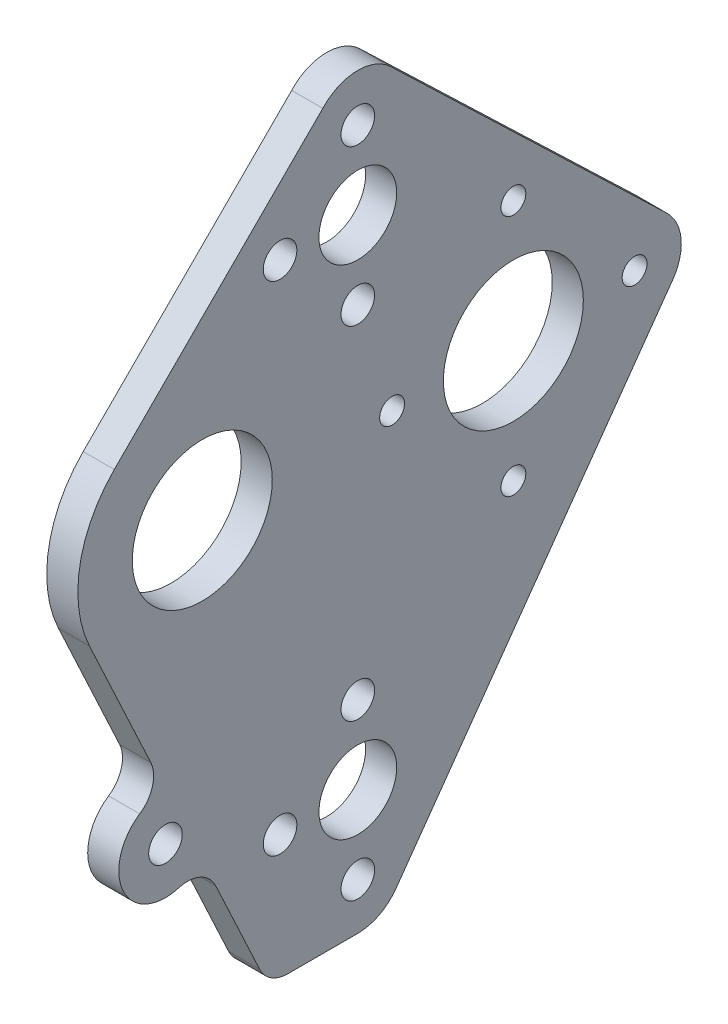
ISO-10303-21;
HEADER;
FILE_DESCRIPTION(('STEP AP214'),'2;1');
FILE_NAME('part.step','',(''),(''),'','','');
FILE_SCHEMA(('AUTOMOTIVE_DESIGN { 1 0 10303 214 1 1 1 1 }'));
ENDSEC;
DATA;
#1=APPLICATION_CONTEXT('core data for automotive mechanical design processes');
#2=APPLICATION_PROTOCOL_DEFINITION('international standard','automotive_design',2000,#1);
#3=PRODUCT_CONTEXT('',#1,'mechanical');
#4=PRODUCT('Part','Part','',(#3));
#5=PRODUCT_RELATED_PRODUCT_CATEGORY('part','',(#4));
#6=PRODUCT_DEFINITION_FORMATION('','',#4);
#7=PRODUCT_DEFINITION_CONTEXT('part definition',#1,'design');
#8=PRODUCT_DEFINITION('design','',#6,#7);
#9=PRODUCT_DEFINITION_SHAPE('','',#8);
#10=(LENGTH_UNIT() NAMED_UNIT(*) SI_UNIT(.MILLI.,.METRE.));
#11=(NAMED_UNIT(*) PLANE_ANGLE_UNIT() SI_UNIT($,.RADIAN.));
#12=(NAMED_UNIT(*) SI_UNIT($,.STERADIAN.) SOLID_ANGLE_UNIT());
#13=UNCERTAINTY_MEASURE_WITH_UNIT(LENGTH_MEASURE(1.E-05),#10,'distance_accuracy_value','');
#14=(GEOMETRIC_REPRESENTATION_CONTEXT(3) GLOBAL_UNCERTAINTY_ASSIGNED_CONTEXT((#13)) GLOBAL_UNIT_ASSIGNED_CONTEXT((#10,
#11,#12)) REPRESENTATION_CONTEXT('',''));
#15=CARTESIAN_POINT('',(0.,0.,0.));
#16=DIRECTION('',(0.,0.,1.));
#17=DIRECTION('',(1.,0.,0.));
#18=AXIS2_PLACEMENT_3D('',#15,#16,#17);
#19=CARTESIAN_POINT('',(6.35,-68.6728859953783,22.0595562798087));
#20=DIRECTION('',(1.,0.,0.));
#21=DIRECTION('',(0.,0.,-1.));
#22=AXIS2_PLACEMENT_3D('',#19,#20,#21);
#23=PLANE('',#22);
#24=CARTESIAN_POINT('',(6.35,-24.7523,-44.4500000000005));
#25=DIRECTION('',(1.,0.,0.));
#26=DIRECTION('',(0.,0.,-1.));
#27=AXIS2_PLACEMENT_3D('',#24,#25,#26);
#28=CIRCLE('',#27,2.54);
#29=CARTESIAN_POINT('',(6.35,-24.7523,-46.9900000000005));
#30=VERTEX_POINT('',#29);
#31=EDGE_CURVE('E412',#30,#30,#28,.T.);
#32=ORIENTED_EDGE('',*,*,#31,.F.);
#33=EDGE_LOOP('',(#32));
#34=FACE_BOUND('',#33,.T.);
#35=CARTESIAN_POINT('',(6.35,24.7523,-44.45));
#36=DIRECTION('',(1.,0.,0.));
#37=DIRECTION('',(0.,0.,-1.));
#38=AXIS2_PLACEMENT_3D('',#35,#36,#37);
#39=CIRCLE('',#38,2.54);
#40=CARTESIAN_POINT('',(6.35,24.7523,-46.99));
#41=VERTEX_POINT('',#40);
#42=EDGE_CURVE('E428',#41,#41,#39,.T.);
#43=ORIENTED_EDGE('',*,*,#42,.F.);
#44=EDGE_LOOP('',(#43));
#45=FACE_BOUND('',#44,.T.);
#46=CARTESIAN_POINT('',(6.35,-79.375,-12.7));
#47=DIRECTION('',(1.,0.,0.));
#48=DIRECTION('',(0.,0.,-1.));
#49=AXIS2_PLACEMENT_3D('',#46,#47,#48);
#50=CIRCLE('',#49,3.42900000000002);
#51=CARTESIAN_POINT('',(6.35,-79.375,-16.129));
#52=VERTEX_POINT('',#51);
#53=EDGE_CURVE('E444',#52,#52,#50,.T.);
#54=ORIENTED_EDGE('',*,*,#53,.F.);
#55=EDGE_LOOP('',(#54));
#56=FACE_BOUND('',#55,.T.);
#57=CARTESIAN_POINT('',(6.35,-63.5,3.17499999999996));
#58=DIRECTION('',(1.,0.,0.));
#59=DIRECTION('',(0.,0.,-1.));
#60=AXIS2_PLACEMENT_3D('',#57,#58,#59);
#61=CIRCLE('',#60,3.429);
#62=CARTESIAN_POINT('',(6.35,-63.5,-0.25400000000004));
#63=VERTEX_POINT('',#62);
#64=EDGE_CURVE('E460',#63,#63,#61,.T.);
#65=ORIENTED_EDGE('',*,*,#64,.F.);
#66=EDGE_LOOP('',(#65));
#67=FACE_BOUND('',#66,.T.);
#68=CARTESIAN_POINT('',(6.35,38.1,3.17500000000001));
#69=DIRECTION('',(1.,0.,0.));
#70=DIRECTION('',(0.,0.,-1.));
#71=AXIS2_PLACEMENT_3D('',#68,#69,#70);
#72=CIRCLE('',#71,3.42899999999915);
#73=CARTESIAN_POINT('',(6.35,38.1,-0.253999999999145));
#74=VERTEX_POINT('',#73);
#75=EDGE_CURVE('E476',#74,#74,#72,.T.);
#76=ORIENTED_EDGE('',*,*,#75,.F.);
#77=EDGE_LOOP('',(#76));
#78=FACE_BOUND('',#77,.T.);
#79=CARTESIAN_POINT('',(6.35,-53.4497190103263,26.5618681243196));
#80=DIRECTION('',(1.,0.,0.));
#81=DIRECTION('',(0.,0.,-1.));
#82=AXIS2_PLACEMENT_3D('',#79,#80,#81);
#83=CIRCLE('',#82,3.429);
#84=CARTESIAN_POINT('',(6.35,-53.4497190103263,23.1328681243196));
#85=VERTEX_POINT('',#84);
#86=EDGE_CURVE('E492',#85,#85,#83,.T.);
#87=ORIENTED_EDGE('',*,*,#86,.F.);
#88=EDGE_LOOP('',(#87));
#89=FACE_BOUND('',#88,.T.);
#90=CARTESIAN_POINT('',(6.35,38.1000000000001,-12.7));
#91=DIRECTION('',(1.,0.,0.));
#92=DIRECTION('',(0.,0.,-1.));
#93=AXIS2_PLACEMENT_3D('',#90,#91,#92);
#94=CIRCLE('',#93,7.93750000000001);
#95=CARTESIAN_POINT('',(6.35,38.1000000000001,-20.6375));
#96=VERTEX_POINT('',#95);
#97=EDGE_CURVE('E508',#96,#96,#94,.T.);
#98=ORIENTED_EDGE('',*,*,#97,.F.);
#99=EDGE_LOOP('',(#98));
#100=FACE_BOUND('',#99,.T.);
#101=CARTESIAN_POINT('',(6.35,-68.6728859953783,22.0595562798087));
#102=DIRECTION('',(-1.,0.,0.));
#103=DIRECTION('',(0.,0.,-1.));
#104=AXIS2_PLACEMENT_3D('',#101,#102,#103);
#105=CIRCLE('',#104,6.35);
#106=CARTESIAN_POINT('',(6.35,-62.5836192013575,23.8604810176131));
#107=VERTEX_POINT('',#106);
#108=CARTESIAN_POINT('',(6.35,-65.9892600333248,16.304501832126));
#109=VERTEX_POINT('',#108);
#110=EDGE_CURVE('E222',#107,#109,#105,.T.);
#111=ORIENTED_EDGE('',*,*,#110,.T.);
#112=DIRECTION('',(0.,-0.906307787036648,-0.422618261740704));
#113=VECTOR('',#112,1.);
#114=CARTESIAN_POINT('',(6.35,-65.9892600333248,16.304501832126));
#115=LINE('',#114,#113);
#116=CARTESIAN_POINT('',(6.35,-85.2336259620534,7.33070662322261));
#117=VERTEX_POINT('',#116);
#118=EDGE_CURVE('E122',#109,#117,#115,.T.);
#119=ORIENTED_EDGE('',*,*,#118,.T.);
#120=CARTESIAN_POINT('',(6.35,-82.55,1.57565217553989));
#121=DIRECTION('',(1.,0.,0.));
#122=DIRECTION('',(0.,0.,-1.));
#123=AXIS2_PLACEMENT_3D('',#120,#121,#122);
#124=CIRCLE('',#123,6.34999999999999);
#125=CARTESIAN_POINT('',(6.35,-88.9,1.57565217553985));
#126=VERTEX_POINT('',#125);
#127=EDGE_CURVE('E267',#117,#126,#124,.T.);
#128=ORIENTED_EDGE('',*,*,#127,.T.);
#129=DIRECTION('',(0.,0.,-1.));
#130=VECTOR('',#129,1.);
#131=CARTESIAN_POINT('',(6.35,-88.9,-12.7));
#132=LINE('',#131,#130);
#133=CARTESIAN_POINT('',(6.35,-88.9,-12.7));
#134=VERTEX_POINT('',#133);
#135=EDGE_CURVE('E287',#126,#134,#132,.T.);
#136=ORIENTED_EDGE('',*,*,#135,.T.);
#137=CARTESIAN_POINT('',(6.35,-79.375,-12.7));
#138=DIRECTION('',(1.,0.,0.));
#139=DIRECTION('',(0.,0.,-1.));
#140=AXIS2_PLACEMENT_3D('',#137,#138,#139);
#141=CIRCLE('',#140,9.525);
#142=CARTESIAN_POINT('',(6.35,-84.8987198737333,-20.4597773007042));
#143=VERTEX_POINT('',#142);
#144=EDGE_CURVE('E283',#134,#143,#141,.T.);
#145=ORIENTED_EDGE('',*,*,#144,.T.);
#146=DIRECTION('',(0.,0.814674782226162,-0.579918096979871));
#147=VECTOR('',#146,1.);
#148=CARTESIAN_POINT('',(6.35,-5.52371987373327,-76.9620773007042));
#149=LINE('',#148,#147);
#150=CARTESIAN_POINT('',(6.35,-5.52371987373327,-76.9620773007042));
#151=VERTEX_POINT('',#150);
#152=EDGE_CURVE('E286',#143,#151,#149,.T.);
#153=ORIENTED_EDGE('',*,*,#152,.T.);
#154=CARTESIAN_POINT('',(6.35,2.70616862252382E-13,-69.2023000000003));
#155=DIRECTION('',(1.,0.,0.));
#156=DIRECTION('',(0.,0.,-1.));
#157=AXIS2_PLACEMENT_3D('',#154,#155,#156);
#158=CIRCLE('',#157,9.52499999999973);
#159=CARTESIAN_POINT('',(6.35,6.87319553611122,-75.796601185295));
#160=VERTEX_POINT('',#159);
#161=EDGE_CURVE('E291',#151,#160,#158,.T.);
#162=ORIENTED_EDGE('',*,*,#161,.T.);
#163=DIRECTION('',(0.,0.692315085070336,0.721595331875182));
#164=VECTOR('',#163,1.);
#165=CARTESIAN_POINT('',(6.35,6.87319553611111,-75.7966011852949));
#166=LINE('',#165,#164);
#167=CARTESIAN_POINT('',(6.35,60.9703519515181,-19.4115008474721));
#168=VERTEX_POINT('',#167);
#169=EDGE_CURVE('E298',#160,#168,#166,.T.);
#170=ORIENTED_EDGE('',*,*,#169,.T.);
#171=CARTESIAN_POINT('',(6.35,53.9750000000001,-12.7000000000001));
#172=DIRECTION('',(1.,0.,0.));
#173=DIRECTION('',(0.,0.,-1.));
#174=AXIS2_PLACEMENT_3D('',#171,#172,#173);
#175=CIRCLE('',#174,9.69428659320659);
#176=CARTESIAN_POINT('',(6.35,60.5158891281602,-5.544864643884));
#177=VERTEX_POINT('',#176);
#178=EDGE_CURVE('E301',#168,#177,#175,.T.);
#179=ORIENTED_EDGE('',*,*,#178,.T.);
#180=DIRECTION('',(0.,-0.707106781186544,0.707106781186551));
#181=VECTOR('',#180,1.);
#182=CARTESIAN_POINT('',(6.35,17.9605122421384,37.0105122421382));
#183=LINE('',#182,#181);
#184=CARTESIAN_POINT('',(6.35,17.9605122421384,37.0105122421382));
#185=VERTEX_POINT('',#184);
#186=EDGE_CURVE('E304',#177,#185,#183,.T.);
#187=ORIENTED_EDGE('',*,*,#186,.T.);
#188=CARTESIAN_POINT('',(6.35,0.,19.05));
#189=DIRECTION('',(1.,0.,0.));
#190=DIRECTION('',(0.,0.,-1.));
#191=AXIS2_PLACEMENT_3D('',#188,#189,#190);
#192=CIRCLE('',#191,25.4);
#193=CARTESIAN_POINT('',(6.35,-10.7345038482139,42.0702177907309));
#194=VERTEX_POINT('',#193);
#195=EDGE_CURVE('E159',#185,#194,#192,.T.);
#196=ORIENTED_EDGE('',*,*,#195,.T.);
#197=DIRECTION('',(0.,-0.906307787036648,-0.422618261740704));
#198=VECTOR('',#197,1.);
#199=CARTESIAN_POINT('',(6.35,-10.7345038482139,42.0702177907309));
#200=LINE('',#199,#198);
#201=CARTESIAN_POINT('',(6.35,-37.531858960416,29.5744058836119));
#202=VERTEX_POINT('',#201);
#203=EDGE_CURVE('E153',#194,#202,#200,.T.);
#204=ORIENTED_EDGE('',*,*,#203,.T.);
#205=CARTESIAN_POINT('',(6.35,-40.2154849224695,35.3294603312946));
#206=DIRECTION('',(-1.,0.,0.));
#207=DIRECTION('',(0.,0.,-1.));
#208=AXIS2_PLACEMENT_3D('',#205,#206,#207);
#209=CIRCLE('',#208,6.35);
#210=CARTESIAN_POINT('',(6.35,-45.5091785576122,31.8224234485046));
#211=VERTEX_POINT('',#210);
#212=EDGE_CURVE('E157',#202,#211,#209,.T.);
#213=ORIENTED_EDGE('',*,*,#212,.T.);
#214=CARTESIAN_POINT('',(6.35,-53.4497190103263,26.5618681243196));
#215=DIRECTION('',(1.,0.,0.));
#216=DIRECTION('',(0.,0.,-1.));
#217=AXIS2_PLACEMENT_3D('',#214,#215,#216);
#218=CIRCLE('',#217,9.525);
#219=EDGE_CURVE('E61',#211,#107,#218,.T.);
#220=ORIENTED_EDGE('',*,*,#219,.T.);
#221=EDGE_LOOP('',(#111,#119,#128,#136,#145,#153,#162,#170,#179,#187,#196,#204,#213,#220));
#222=FACE_BOUND('',#221,.T.);
#223=CARTESIAN_POINT('',(6.35,0.,19.05));
#224=DIRECTION('',(1.,0.,0.));
#225=DIRECTION('',(0.,0.,-1.));
#226=AXIS2_PLACEMENT_3D('',#223,#224,#225);
#227=CIRCLE('',#226,14.2875);
#228=CARTESIAN_POINT('',(6.35,0.,4.76250000000001));
#229=VERTEX_POINT('',#228);
#230=EDGE_CURVE('E186',#229,#229,#227,.T.);
#231=ORIENTED_EDGE('',*,*,#230,.F.);
#232=EDGE_LOOP('',(#231));
#233=FACE_BOUND('',#232,.T.);
#234=CARTESIAN_POINT('',(6.35,-63.5,-12.7));
#235=DIRECTION('',(1.,0.,0.));
#236=DIRECTION('',(0.,0.,-1.));
#237=AXIS2_PLACEMENT_3D('',#234,#235,#236);
#238=CIRCLE('',#237,7.93750000000001);
#239=CARTESIAN_POINT('',(6.35,-63.5,-20.6375));
#240=VERTEX_POINT('',#239);
#241=EDGE_CURVE('E500',#240,#240,#238,.T.);
#242=ORIENTED_EDGE('',*,*,#241,.F.);
#243=EDGE_LOOP('',(#242));
#244=FACE_BOUND('',#243,.T.);
#245=CARTESIAN_POINT('',(6.35,53.9750000000001,-12.7000000000001));
#246=DIRECTION('',(1.,0.,0.));
#247=DIRECTION('',(0.,0.,-1.));
#248=AXIS2_PLACEMENT_3D('',#245,#246,#247);
#249=CIRCLE('',#248,3.42899999999915);
#250=CARTESIAN_POINT('',(6.35,53.9750000000001,-16.1289999999992));
#251=VERTEX_POINT('',#250);
#252=EDGE_CURVE('E484',#251,#251,#249,.T.);
#253=ORIENTED_EDGE('',*,*,#252,.F.);
#254=EDGE_LOOP('',(#253));
#255=FACE_BOUND('',#254,.T.);
#256=CARTESIAN_POINT('',(6.35,22.225,-12.7000000000002));
#257=DIRECTION('',(1.,0.,0.));
#258=DIRECTION('',(0.,0.,-1.));
#259=AXIS2_PLACEMENT_3D('',#256,#257,#258);
#260=CIRCLE('',#259,3.42899999999915);
#261=CARTESIAN_POINT('',(6.35,22.225,-16.1289999999993));
#262=VERTEX_POINT('',#261);
#263=EDGE_CURVE('E468',#262,#262,#260,.T.);
#264=ORIENTED_EDGE('',*,*,#263,.F.);
#265=EDGE_LOOP('',(#264));
#266=FACE_BOUND('',#265,.T.);
#267=CARTESIAN_POINT('',(6.35,-47.625,-12.7));
#268=DIRECTION('',(1.,0.,0.));
#269=DIRECTION('',(0.,0.,-1.));
#270=AXIS2_PLACEMENT_3D('',#267,#268,#269);
#271=CIRCLE('',#270,3.429);
#272=CARTESIAN_POINT('',(6.35,-47.625,-16.129));
#273=VERTEX_POINT('',#272);
#274=EDGE_CURVE('E452',#273,#273,#271,.T.);
#275=ORIENTED_EDGE('',*,*,#274,.F.);
#276=EDGE_LOOP('',(#275));
#277=FACE_BOUND('',#276,.T.);
#278=CARTESIAN_POINT('',(6.35,0.,-44.45));
#279=DIRECTION('',(1.,0.,0.));
#280=DIRECTION('',(0.,0.,-1.));
#281=AXIS2_PLACEMENT_3D('',#278,#279,#280);
#282=CIRCLE('',#281,14.2875);
#283=CARTESIAN_POINT('',(6.35,0.,-58.7375));
#284=VERTEX_POINT('',#283);
#285=EDGE_CURVE('E436',#284,#284,#282,.T.);
#286=ORIENTED_EDGE('',*,*,#285,.F.);
#287=EDGE_LOOP('',(#286));
#288=FACE_BOUND('',#287,.T.);
#289=CARTESIAN_POINT('',(6.35,2.70616862252382E-13,-69.2023000000003));
#290=DIRECTION('',(1.,0.,0.));
#291=DIRECTION('',(0.,0.,-1.));
#292=AXIS2_PLACEMENT_3D('',#289,#290,#291);
#293=CIRCLE('',#292,2.54000000000001);
#294=CARTESIAN_POINT('',(6.35,2.70616862252382E-13,-71.7423000000003));
#295=VERTEX_POINT('',#294);
#296=EDGE_CURVE('E420',#295,#295,#293,.T.);
#297=ORIENTED_EDGE('',*,*,#296,.F.);
#298=EDGE_LOOP('',(#297));
#299=FACE_BOUND('',#298,.T.);
#300=CARTESIAN_POINT('',(6.35,0.,-19.6977000000003));
#301=DIRECTION('',(1.,0.,0.));
#302=DIRECTION('',(0.,0.,-1.));
#303=AXIS2_PLACEMENT_3D('',#300,#301,#302);
#304=CIRCLE('',#303,2.54);
#305=CARTESIAN_POINT('',(6.35,0.,-22.2377000000003));
#306=VERTEX_POINT('',#305);
#307=EDGE_CURVE('E401',#306,#306,#304,.T.);
#308=ORIENTED_EDGE('',*,*,#307,.F.);
#309=EDGE_LOOP('',(#308));
#310=FACE_BOUND('',#309,.T.);
#311=ADVANCED_FACE('F43',(#34,#45,#56,#67,#78,#89,#100,#222,#233,#244,#255,#266,#277,#288,#299,
#310),#23,.T.);
#312=CARTESIAN_POINT('',(0.,-68.6728859953783,22.0595562798087));
#313=DIRECTION('',(1.,0.,0.));
#314=DIRECTION('',(0.,0.,-1.));
#315=AXIS2_PLACEMENT_3D('',#312,#313,#314);
#316=PLANE('',#315);
#317=CARTESIAN_POINT('',(0.,-68.6728859953783,22.0595562798087));
#318=DIRECTION('',(-1.,0.,0.));
#319=DIRECTION('',(0.,0.,-1.));
#320=AXIS2_PLACEMENT_3D('',#317,#318,#319);
#321=CIRCLE('',#320,6.35);
#322=CARTESIAN_POINT('',(0.,-62.5836192013575,23.8604810176131));
#323=VERTEX_POINT('',#322);
#324=CARTESIAN_POINT('',(0.,-65.9892600333248,16.304501832126));
#325=VERTEX_POINT('',#324);
#326=EDGE_CURVE('E181',#323,#325,#321,.T.);
#327=ORIENTED_EDGE('',*,*,#326,.F.);
#328=CARTESIAN_POINT('',(0.,-53.4497190103263,26.5618681243196));
#329=DIRECTION('',(1.,0.,0.));
#330=DIRECTION('',(0.,0.,-1.));
#331=AXIS2_PLACEMENT_3D('',#328,#329,#330);
#332=CIRCLE('',#331,9.525);
#333=CARTESIAN_POINT('',(0.,-45.5091785576122,31.8224234485046));
#334=VERTEX_POINT('',#333);
#335=EDGE_CURVE('E114',#334,#323,#332,.T.);
#336=ORIENTED_EDGE('',*,*,#335,.F.);
#337=CARTESIAN_POINT('',(0.,-40.2154849224695,35.3294603312946));
#338=DIRECTION('',(-1.,0.,0.));
#339=DIRECTION('',(0.,0.,-1.));
#340=AXIS2_PLACEMENT_3D('',#337,#338,#339);
#341=CIRCLE('',#340,6.35);
#342=CARTESIAN_POINT('',(0.,-37.531858960416,29.5744058836119));
#343=VERTEX_POINT('',#342);
#344=EDGE_CURVE('E108',#343,#334,#341,.T.);
#345=ORIENTED_EDGE('',*,*,#344,.F.);
#346=DIRECTION('',(0.,-0.906307787036648,-0.422618261740704));
#347=VECTOR('',#346,1.);
#348=CARTESIAN_POINT('',(0.,-10.7345038482139,42.0702177907309));
#349=LINE('',#348,#347);
#350=CARTESIAN_POINT('',(0.,-10.7345038482139,42.0702177907309));
#351=VERTEX_POINT('',#350);
#352=EDGE_CURVE('E168',#351,#343,#349,.T.);
#353=ORIENTED_EDGE('',*,*,#352,.F.);
#354=CARTESIAN_POINT('',(0.,0.,19.05));
#355=DIRECTION('',(1.,0.,0.));
#356=DIRECTION('',(0.,0.,-1.));
#357=AXIS2_PLACEMENT_3D('',#354,#355,#356);
#358=CIRCLE('',#357,25.4);
#359=CARTESIAN_POINT('',(0.,17.9605122421384,37.0105122421382));
#360=VERTEX_POINT('',#359);
#361=EDGE_CURVE('E213',#360,#351,#358,.T.);
#362=ORIENTED_EDGE('',*,*,#361,.F.);
#363=DIRECTION('',(0.,-0.707106781186544,0.707106781186551));
#364=VECTOR('',#363,1.);
#365=CARTESIAN_POINT('',(0.,17.9605122421384,37.0105122421382));
#366=LINE('',#365,#364);
#367=CARTESIAN_POINT('',(0.,60.5158891281602,-5.544864643884));
#368=VERTEX_POINT('',#367);
#369=EDGE_CURVE('E210',#368,#360,#366,.T.);
#370=ORIENTED_EDGE('',*,*,#369,.F.);
#371=CARTESIAN_POINT('',(0.,53.9750000000001,-12.7000000000001));
#372=DIRECTION('',(1.,0.,0.));
#373=DIRECTION('',(0.,0.,-1.));
#374=AXIS2_PLACEMENT_3D('',#371,#372,#373);
#375=CIRCLE('',#374,9.69428659320659);
#376=CARTESIAN_POINT('',(0.,60.9703519515181,-19.4115008474721));
#377=VERTEX_POINT('',#376);
#378=EDGE_CURVE('E207',#377,#368,#375,.T.);
#379=ORIENTED_EDGE('',*,*,#378,.F.);
#380=DIRECTION('',(0.,0.692315085070336,0.721595331875182));
#381=VECTOR('',#380,1.);
#382=CARTESIAN_POINT('',(0.,6.87319553611111,-75.7966011852949));
#383=LINE('',#382,#381);
#384=CARTESIAN_POINT('',(0.,6.87319553611122,-75.796601185295));
#385=VERTEX_POINT('',#384);
#386=EDGE_CURVE('E204',#385,#377,#383,.T.);
#387=ORIENTED_EDGE('',*,*,#386,.F.);
#388=CARTESIAN_POINT('',(0.,2.70616862252382E-13,-69.2023000000003));
#389=DIRECTION('',(1.,0.,0.));
#390=DIRECTION('',(0.,0.,-1.));
#391=AXIS2_PLACEMENT_3D('',#388,#389,#390);
#392=CIRCLE('',#391,9.52499999999973);
#393=CARTESIAN_POINT('',(0.,-5.52371987373327,-76.9620773007042));
#394=VERTEX_POINT('',#393);
#395=EDGE_CURVE('E201',#394,#385,#392,.T.);
#396=ORIENTED_EDGE('',*,*,#395,.F.);
#397=DIRECTION('',(0.,0.814674782226162,-0.579918096979871));
#398=VECTOR('',#397,1.);
#399=CARTESIAN_POINT('',(0.,-5.52371987373327,-76.9620773007042));
#400=LINE('',#399,#398);
#401=CARTESIAN_POINT('',(0.,-84.8987198737333,-20.4597773007042));
#402=VERTEX_POINT('',#401);
#403=EDGE_CURVE('E198',#402,#394,#400,.T.);
#404=ORIENTED_EDGE('',*,*,#403,.F.);
#405=CARTESIAN_POINT('',(0.,-79.375,-12.7));
#406=DIRECTION('',(1.,0.,0.));
#407=DIRECTION('',(0.,0.,-1.));
#408=AXIS2_PLACEMENT_3D('',#405,#406,#407);
#409=CIRCLE('',#408,9.525);
#410=CARTESIAN_POINT('',(0.,-88.9,-12.7));
#411=VERTEX_POINT('',#410);
#412=EDGE_CURVE('E195',#411,#402,#409,.T.);
#413=ORIENTED_EDGE('',*,*,#412,.F.);
#414=DIRECTION('',(0.,0.,-1.));
#415=VECTOR('',#414,1.);
#416=CARTESIAN_POINT('',(0.,-88.9,-12.7));
#417=LINE('',#416,#415);
#418=CARTESIAN_POINT('',(0.,-88.9,1.57565217553985));
#419=VERTEX_POINT('',#418);
#420=EDGE_CURVE('E192',#419,#411,#417,.T.);
#421=ORIENTED_EDGE('',*,*,#420,.F.);
#422=CARTESIAN_POINT('',(0.,-82.55,1.57565217553989));
#423=DIRECTION('',(1.,0.,0.));
#424=DIRECTION('',(0.,0.,-1.));
#425=AXIS2_PLACEMENT_3D('',#422,#423,#424);
#426=CIRCLE('',#425,6.34999999999999);
#427=CARTESIAN_POINT('',(0.,-85.2336259620534,7.33070662322261));
#428=VERTEX_POINT('',#427);
#429=EDGE_CURVE('E189',#428,#419,#426,.T.);
#430=ORIENTED_EDGE('',*,*,#429,.F.);
#431=DIRECTION('',(0.,-0.906307787036648,-0.422618261740704));
#432=VECTOR('',#431,1.);
#433=CARTESIAN_POINT('',(0.,-65.9892600333248,16.304501832126));
#434=LINE('',#433,#432);
#435=EDGE_CURVE('E185',#325,#428,#434,.T.);
#436=ORIENTED_EDGE('',*,*,#435,.F.);
#437=EDGE_LOOP('',(#327,#336,#345,#353,#362,#370,#379,#387,#396,#404,#413,#421,#430,#436));
#438=FACE_BOUND('',#437,.T.);
#439=CARTESIAN_POINT('',(0.,0.,19.05));
#440=DIRECTION('',(1.,0.,0.));
#441=DIRECTION('',(0.,0.,-1.));
#442=AXIS2_PLACEMENT_3D('',#439,#440,#441);
#443=CIRCLE('',#442,14.2875);
#444=CARTESIAN_POINT('',(0.,0.,4.76250000000001));
#445=VERTEX_POINT('',#444);
#446=EDGE_CURVE('E512',#445,#445,#443,.T.);
#447=ORIENTED_EDGE('',*,*,#446,.T.);
#448=EDGE_LOOP('',(#447));
#449=FACE_BOUND('',#448,.T.);
#450=CARTESIAN_POINT('',(0.,38.1000000000001,-12.7));
#451=DIRECTION('',(1.,0.,0.));
#452=DIRECTION('',(0.,0.,-1.));
#453=AXIS2_PLACEMENT_3D('',#450,#451,#452);
#454=CIRCLE('',#453,7.93750000000001);
#455=CARTESIAN_POINT('',(0.,38.1000000000001,-20.6375));
#456=VERTEX_POINT('',#455);
#457=EDGE_CURVE('E504',#456,#456,#454,.T.);
#458=ORIENTED_EDGE('',*,*,#457,.T.);
#459=EDGE_LOOP('',(#458));
#460=FACE_BOUND('',#459,.T.);
#461=CARTESIAN_POINT('',(0.,-63.5,-12.7));
#462=DIRECTION('',(1.,0.,0.));
#463=DIRECTION('',(0.,0.,-1.));
#464=AXIS2_PLACEMENT_3D('',#461,#462,#463);
#465=CIRCLE('',#464,7.93750000000001);
#466=CARTESIAN_POINT('',(0.,-63.5,-20.6375));
#467=VERTEX_POINT('',#466);
#468=EDGE_CURVE('E496',#467,#467,#465,.T.);
#469=ORIENTED_EDGE('',*,*,#468,.T.);
#470=EDGE_LOOP('',(#469));
#471=FACE_BOUND('',#470,.T.);
#472=CARTESIAN_POINT('',(0.,-53.4497190103263,26.5618681243196));
#473=DIRECTION('',(1.,0.,0.));
#474=DIRECTION('',(0.,0.,-1.));
#475=AXIS2_PLACEMENT_3D('',#472,#473,#474);
#476=CIRCLE('',#475,3.429);
#477=CARTESIAN_POINT('',(0.,-53.4497190103263,23.1328681243196));
#478=VERTEX_POINT('',#477);
#479=EDGE_CURVE('E488',#478,#478,#476,.T.);
#480=ORIENTED_EDGE('',*,*,#479,.T.);
#481=EDGE_LOOP('',(#480));
#482=FACE_BOUND('',#481,.T.);
#483=CARTESIAN_POINT('',(0.,53.9750000000001,-12.7000000000001));
#484=DIRECTION('',(1.,0.,0.));
#485=DIRECTION('',(0.,0.,-1.));
#486=AXIS2_PLACEMENT_3D('',#483,#484,#485);
#487=CIRCLE('',#486,3.42899999999915);
#488=CARTESIAN_POINT('',(0.,53.9750000000001,-16.1289999999992));
#489=VERTEX_POINT('',#488);
#490=EDGE_CURVE('E480',#489,#489,#487,.T.);
#491=ORIENTED_EDGE('',*,*,#490,.T.);
#492=EDGE_LOOP('',(#491));
#493=FACE_BOUND('',#492,.T.);
#494=CARTESIAN_POINT('',(0.,38.1,3.17500000000001));
#495=DIRECTION('',(1.,0.,0.));
#496=DIRECTION('',(0.,0.,-1.));
#497=AXIS2_PLACEMENT_3D('',#494,#495,#496);
#498=CIRCLE('',#497,3.42899999999915);
#499=CARTESIAN_POINT('',(0.,38.1,-0.253999999999145));
#500=VERTEX_POINT('',#499);
#501=EDGE_CURVE('E472',#500,#500,#498,.T.);
#502=ORIENTED_EDGE('',*,*,#501,.T.);
#503=EDGE_LOOP('',(#502));
#504=FACE_BOUND('',#503,.T.);
#505=CARTESIAN_POINT('',(0.,22.225,-12.7000000000002));
#506=DIRECTION('',(1.,0.,0.));
#507=DIRECTION('',(0.,0.,-1.));
#508=AXIS2_PLACEMENT_3D('',#505,#506,#507);
#509=CIRCLE('',#508,3.42899999999915);
#510=CARTESIAN_POINT('',(0.,22.225,-16.1289999999993));
#511=VERTEX_POINT('',#510);
#512=EDGE_CURVE('E464',#511,#511,#509,.T.);
#513=ORIENTED_EDGE('',*,*,#512,.T.);
#514=EDGE_LOOP('',(#513));
#515=FACE_BOUND('',#514,.T.);
#516=CARTESIAN_POINT('',(0.,-63.5,3.17499999999996));
#517=DIRECTION('',(1.,0.,0.));
#518=DIRECTION('',(0.,0.,-1.));
#519=AXIS2_PLACEMENT_3D('',#516,#517,#518);
#520=CIRCLE('',#519,3.429);
#521=CARTESIAN_POINT('',(0.,-63.5,-0.25400000000004));
#522=VERTEX_POINT('',#521);
#523=EDGE_CURVE('E456',#522,#522,#520,.T.);
#524=ORIENTED_EDGE('',*,*,#523,.T.);
#525=EDGE_LOOP('',(#524));
#526=FACE_BOUND('',#525,.T.);
#527=CARTESIAN_POINT('',(0.,-47.625,-12.7));
#528=DIRECTION('',(1.,0.,0.));
#529=DIRECTION('',(0.,0.,-1.));
#530=AXIS2_PLACEMENT_3D('',#527,#528,#529);
#531=CIRCLE('',#530,3.429);
#532=CARTESIAN_POINT('',(0.,-47.625,-16.129));
#533=VERTEX_POINT('',#532);
#534=EDGE_CURVE('E448',#533,#533,#531,.T.);
#535=ORIENTED_EDGE('',*,*,#534,.T.);
#536=EDGE_LOOP('',(#535));
#537=FACE_BOUND('',#536,.T.);
#538=CARTESIAN_POINT('',(0.,-79.375,-12.7));
#539=DIRECTION('',(1.,0.,0.));
#540=DIRECTION('',(0.,0.,-1.));
#541=AXIS2_PLACEMENT_3D('',#538,#539,#540);
#542=CIRCLE('',#541,3.42900000000002);
#543=CARTESIAN_POINT('',(0.,-79.375,-16.129));
#544=VERTEX_POINT('',#543);
#545=EDGE_CURVE('E440',#544,#544,#542,.T.);
#546=ORIENTED_EDGE('',*,*,#545,.T.);
#547=EDGE_LOOP('',(#546));
#548=FACE_BOUND('',#547,.T.);
#549=CARTESIAN_POINT('',(0.,0.,-44.45));
#550=DIRECTION('',(1.,0.,0.));
#551=DIRECTION('',(0.,0.,-1.));
#552=AXIS2_PLACEMENT_3D('',#549,#550,#551);
#553=CIRCLE('',#552,14.2875);
#554=CARTESIAN_POINT('',(0.,0.,-58.7375));
#555=VERTEX_POINT('',#554);
#556=EDGE_CURVE('E432',#555,#555,#553,.T.);
#557=ORIENTED_EDGE('',*,*,#556,.T.);
#558=EDGE_LOOP('',(#557));
#559=FACE_BOUND('',#558,.T.);
#560=CARTESIAN_POINT('',(0.,24.7523,-44.45));
#561=DIRECTION('',(1.,0.,0.));
#562=DIRECTION('',(0.,0.,-1.));
#563=AXIS2_PLACEMENT_3D('',#560,#561,#562);
#564=CIRCLE('',#563,2.54);
#565=CARTESIAN_POINT('',(0.,24.7523,-46.99));
#566=VERTEX_POINT('',#565);
#567=EDGE_CURVE('E424',#566,#566,#564,.T.);
#568=ORIENTED_EDGE('',*,*,#567,.T.);
#569=EDGE_LOOP('',(#568));
#570=FACE_BOUND('',#569,.T.);
#571=CARTESIAN_POINT('',(0.,2.70616862252382E-13,-69.2023000000003));
#572=DIRECTION('',(1.,0.,0.));
#573=DIRECTION('',(0.,0.,-1.));
#574=AXIS2_PLACEMENT_3D('',#571,#572,#573);
#575=CIRCLE('',#574,2.54000000000001);
#576=CARTESIAN_POINT('',(0.,2.70616862252382E-13,-71.7423000000003));
#577=VERTEX_POINT('',#576);
#578=EDGE_CURVE('E416',#577,#577,#575,.T.);
#579=ORIENTED_EDGE('',*,*,#578,.T.);
#580=EDGE_LOOP('',(#579));
#581=FACE_BOUND('',#580,.T.);
#582=CARTESIAN_POINT('',(0.,-24.7523,-44.4500000000005));
#583=DIRECTION('',(1.,0.,0.));
#584=DIRECTION('',(0.,0.,-1.));
#585=AXIS2_PLACEMENT_3D('',#582,#583,#584);
#586=CIRCLE('',#585,2.54);
#587=CARTESIAN_POINT('',(0.,-24.7523,-46.9900000000005));
#588=VERTEX_POINT('',#587);
#589=EDGE_CURVE('E409',#588,#588,#586,.T.);
#590=ORIENTED_EDGE('',*,*,#589,.T.);
#591=EDGE_LOOP('',(#590));
#592=FACE_BOUND('',#591,.T.);
#593=CARTESIAN_POINT('',(0.,0.,-19.6977000000003));
#594=DIRECTION('',(1.,0.,0.));
#595=DIRECTION('',(0.,0.,-1.));
#596=AXIS2_PLACEMENT_3D('',#593,#594,#595);
#597=CIRCLE('',#596,2.54);
#598=CARTESIAN_POINT('',(0.,0.,-22.2377000000003));
#599=VERTEX_POINT('',#598);
#600=EDGE_CURVE('E404',#599,#599,#597,.T.);
#601=ORIENTED_EDGE('',*,*,#600,.T.);
#602=EDGE_LOOP('',(#601));
#603=FACE_BOUND('',#602,.T.);
#604=ADVANCED_FACE('F271',(#438,#449,#460,#471,#482,#493,#504,#515,#526,#537,#548,#559,#570,
#581,#592,#603),#316,.F.);
#605=CARTESIAN_POINT('',(6.35,-68.6728859953783,22.0595562798087));
#606=DIRECTION('',(-1.,0.,0.));
#607=DIRECTION('',(0.,0.,1.));
#608=AXIS2_PLACEMENT_3D('',#605,#606,#607);
#609=CYLINDRICAL_SURFACE('',#608,6.35);
#610=ORIENTED_EDGE('',*,*,#326,.T.);
#611=DIRECTION('',(-1.,0.,0.));
#612=VECTOR('',#611,1.);
#613=CARTESIAN_POINT('',(6.35,-65.9892600333248,16.304501832126));
#614=LINE('',#613,#612);
#615=EDGE_CURVE('E11',#109,#325,#614,.T.);
#616=ORIENTED_EDGE('',*,*,#615,.F.);
#617=ORIENTED_EDGE('',*,*,#110,.F.);
#618=DIRECTION('',(-1.,0.,0.));
#619=VECTOR('',#618,1.);
#620=CARTESIAN_POINT('',(6.35,-62.5836192013575,23.8604810176131));
#621=LINE('',#620,#619);
#622=EDGE_CURVE('E177',#107,#323,#621,.T.);
#623=ORIENTED_EDGE('',*,*,#622,.T.);
#624=EDGE_LOOP('',(#610,#616,#617,#623));
#625=FACE_BOUND('',#624,.T.);
#626=ADVANCED_FACE('F45',(#625),#609,.F.);
#627=CARTESIAN_POINT('',(6.35,-65.9892600333248,16.304501832126));
#628=DIRECTION('',(0.,0.422618261740704,-0.906307787036648));
#629=DIRECTION('',(0.,0.906307787036648,0.422618261740704));
#630=AXIS2_PLACEMENT_3D('',#627,#628,#629);
#631=PLANE('',#630);
#632=ORIENTED_EDGE('',*,*,#435,.T.);
#633=DIRECTION('',(-1.,0.,0.));
#634=VECTOR('',#633,1.);
#635=CARTESIAN_POINT('',(6.35,-85.2336259620534,7.33070662322261));
#636=LINE('',#635,#634);
#637=EDGE_CURVE('E53',#117,#428,#636,.T.);
#638=ORIENTED_EDGE('',*,*,#637,.F.);
#639=ORIENTED_EDGE('',*,*,#118,.F.);
#640=ORIENTED_EDGE('',*,*,#615,.T.);
#641=EDGE_LOOP('',(#632,#638,#639,#640));
#642=FACE_BOUND('',#641,.T.);
#643=ADVANCED_FACE('F759',(#642),#631,.F.);
#644=CARTESIAN_POINT('',(6.35,-82.55,1.57565217553989));
#645=DIRECTION('',(-1.,0.,0.));
#646=DIRECTION('',(0.,0.,1.));
#647=AXIS2_PLACEMENT_3D('',#644,#645,#646);
#648=CYLINDRICAL_SURFACE('',#647,6.34999999999999);
#649=ORIENTED_EDGE('',*,*,#429,.T.);
#650=DIRECTION('',(-1.,0.,0.));
#651=VECTOR('',#650,1.);
#652=CARTESIAN_POINT('',(6.35,-88.9,1.57565217553985));
#653=LINE('',#652,#651);
#654=EDGE_CURVE('E257',#126,#419,#653,.T.);
#655=ORIENTED_EDGE('',*,*,#654,.F.);
#656=ORIENTED_EDGE('',*,*,#127,.F.);
#657=ORIENTED_EDGE('',*,*,#637,.T.);
#658=EDGE_LOOP('',(#649,#655,#656,#657));
#659=FACE_BOUND('',#658,.T.);
#660=ADVANCED_FACE('F265',(#659),#648,.T.);
#661=CARTESIAN_POINT('',(6.35,-88.9,-12.7));
#662=DIRECTION('',(0.,1.,0.));
#663=DIRECTION('',(0.,0.,1.));
#664=AXIS2_PLACEMENT_3D('',#661,#662,#663);
#665=PLANE('',#664);
#666=ORIENTED_EDGE('',*,*,#420,.T.);
#667=DIRECTION('',(-1.,0.,0.));
#668=VECTOR('',#667,1.);
#669=CARTESIAN_POINT('',(6.35,-88.9,-12.7));
#670=LINE('',#669,#668);
#671=EDGE_CURVE('E253',#134,#411,#670,.T.);
#672=ORIENTED_EDGE('',*,*,#671,.F.);
#673=ORIENTED_EDGE('',*,*,#135,.F.);
#674=ORIENTED_EDGE('',*,*,#654,.T.);
#675=EDGE_LOOP('',(#666,#672,#673,#674));
#676=FACE_BOUND('',#675,.T.);
#677=ADVANCED_FACE('F277',(#676),#665,.F.);
#678=CARTESIAN_POINT('',(6.35,-79.375,-12.7));
#679=DIRECTION('',(-1.,0.,0.));
#680=DIRECTION('',(0.,0.,1.));
#681=AXIS2_PLACEMENT_3D('',#678,#679,#680);
#682=CYLINDRICAL_SURFACE('',#681,9.525);
#683=ORIENTED_EDGE('',*,*,#412,.T.);
#684=DIRECTION('',(-1.,0.,0.));
#685=VECTOR('',#684,1.);
#686=CARTESIAN_POINT('',(6.35,-84.8987198737333,-20.4597773007042));
#687=LINE('',#686,#685);
#688=EDGE_CURVE('E249',#143,#402,#687,.T.);
#689=ORIENTED_EDGE('',*,*,#688,.F.);
#690=ORIENTED_EDGE('',*,*,#144,.F.);
#691=ORIENTED_EDGE('',*,*,#671,.T.);
#692=EDGE_LOOP('',(#683,#689,#690,#691));
#693=FACE_BOUND('',#692,.T.);
#694=ADVANCED_FACE('F281',(#693),#682,.T.);
#695=CARTESIAN_POINT('',(6.35,-5.52371987373327,-76.9620773007042));
#696=DIRECTION('',(0.,0.579918096979871,0.814674782226162));
#697=DIRECTION('',(0.,-0.814674782226162,0.579918096979871));
#698=AXIS2_PLACEMENT_3D('',#695,#696,#697);
#699=PLANE('',#698);
#700=ORIENTED_EDGE('',*,*,#403,.T.);
#701=DIRECTION('',(-1.,0.,0.));
#702=VECTOR('',#701,1.);
#703=CARTESIAN_POINT('',(6.35,-5.52371987373327,-76.9620773007042));
#704=LINE('',#703,#702);
#705=EDGE_CURVE('E245',#151,#394,#704,.T.);
#706=ORIENTED_EDGE('',*,*,#705,.F.);
#707=ORIENTED_EDGE('',*,*,#152,.F.);
#708=ORIENTED_EDGE('',*,*,#688,.T.);
#709=EDGE_LOOP('',(#700,#706,#707,#708));
#710=FACE_BOUND('',#709,.T.);
#711=ADVANCED_FACE('F720',(#710),#699,.F.);
#712=CARTESIAN_POINT('',(6.35,2.70616862252382E-13,-69.2023000000003));
#713=DIRECTION('',(-1.,0.,0.));
#714=DIRECTION('',(0.,0.,1.));
#715=AXIS2_PLACEMENT_3D('',#712,#713,#714);
#716=CYLINDRICAL_SURFACE('',#715,9.52499999999973);
#717=ORIENTED_EDGE('',*,*,#395,.T.);
#718=DIRECTION('',(-1.,0.,0.));
#719=VECTOR('',#718,1.);
#720=CARTESIAN_POINT('',(6.35,6.87319553611122,-75.796601185295));
#721=LINE('',#720,#719);
#722=EDGE_CURVE('E241',#160,#385,#721,.T.);
#723=ORIENTED_EDGE('',*,*,#722,.F.);
#724=ORIENTED_EDGE('',*,*,#161,.F.);
#725=ORIENTED_EDGE('',*,*,#705,.T.);
#726=EDGE_LOOP('',(#717,#723,#724,#725));
#727=FACE_BOUND('',#726,.T.);
#728=ADVANCED_FACE('F709',(#727),#716,.T.);
#729=CARTESIAN_POINT('',(6.35,6.87319553611111,-75.7966011852949));
#730=DIRECTION('',(0.,-0.721595331875182,0.692315085070336));
#731=DIRECTION('',(0.,-0.692315085070336,-0.721595331875182));
#732=AXIS2_PLACEMENT_3D('',#729,#730,#731);
#733=PLANE('',#732);
#734=ORIENTED_EDGE('',*,*,#386,.T.);
#735=DIRECTION('',(-1.,0.,0.));
#736=VECTOR('',#735,1.);
#737=CARTESIAN_POINT('',(6.35,60.9703519515181,-19.4115008474721));
#738=LINE('',#737,#736);
#739=EDGE_CURVE('E237',#168,#377,#738,.T.);
#740=ORIENTED_EDGE('',*,*,#739,.F.);
#741=ORIENTED_EDGE('',*,*,#169,.F.);
#742=ORIENTED_EDGE('',*,*,#722,.T.);
#743=EDGE_LOOP('',(#734,#740,#741,#742));
#744=FACE_BOUND('',#743,.T.);
#745=ADVANCED_FACE('F698',(#744),#733,.F.);
#746=CARTESIAN_POINT('',(6.35,53.9750000000001,-12.7000000000001));
#747=DIRECTION('',(-1.,0.,0.));
#748=DIRECTION('',(0.,0.,1.));
#749=AXIS2_PLACEMENT_3D('',#746,#747,#748);
#750=CYLINDRICAL_SURFACE('',#749,9.69428659320659);
#751=ORIENTED_EDGE('',*,*,#378,.T.);
#752=DIRECTION('',(-1.,0.,0.));
#753=VECTOR('',#752,1.);
#754=CARTESIAN_POINT('',(6.35,60.5158891281602,-5.544864643884));
#755=LINE('',#754,#753);
#756=EDGE_CURVE('E233',#177,#368,#755,.T.);
#757=ORIENTED_EDGE('',*,*,#756,.F.);
#758=ORIENTED_EDGE('',*,*,#178,.F.);
#759=ORIENTED_EDGE('',*,*,#739,.T.);
#760=EDGE_LOOP('',(#751,#757,#758,#759));
#761=FACE_BOUND('',#760,.T.);
#762=ADVANCED_FACE('F688',(#761),#750,.T.);
#763=CARTESIAN_POINT('',(6.35,17.9605122421384,37.0105122421382));
#764=DIRECTION('',(0.,-0.707106781186551,-0.707106781186544));
#765=DIRECTION('',(0.,0.707106781186544,-0.707106781186551));
#766=AXIS2_PLACEMENT_3D('',#763,#764,#765);
#767=PLANE('',#766);
#768=ORIENTED_EDGE('',*,*,#369,.T.);
#769=DIRECTION('',(-1.,0.,0.));
#770=VECTOR('',#769,1.);
#771=CARTESIAN_POINT('',(6.35,17.9605122421384,37.0105122421382));
#772=LINE('',#771,#770);
#773=EDGE_CURVE('E229',#185,#360,#772,.T.);
#774=ORIENTED_EDGE('',*,*,#773,.F.);
#775=ORIENTED_EDGE('',*,*,#186,.F.);
#776=ORIENTED_EDGE('',*,*,#756,.T.);
#777=EDGE_LOOP('',(#768,#774,#775,#776));
#778=FACE_BOUND('',#777,.T.);
#779=ADVANCED_FACE('F312',(#778),#767,.F.);
#780=CARTESIAN_POINT('',(6.35,0.,19.05));
#781=DIRECTION('',(-1.,0.,0.));
#782=DIRECTION('',(0.,0.,1.));
#783=AXIS2_PLACEMENT_3D('',#780,#781,#782);
#784=CYLINDRICAL_SURFACE('',#783,25.4);
#785=ORIENTED_EDGE('',*,*,#361,.T.);
#786=DIRECTION('',(-1.,0.,0.));
#787=VECTOR('',#786,1.);
#788=CARTESIAN_POINT('',(6.35,-10.7345038482139,42.0702177907309));
#789=LINE('',#788,#787);
#790=EDGE_CURVE('E170',#194,#351,#789,.T.);
#791=ORIENTED_EDGE('',*,*,#790,.F.);
#792=ORIENTED_EDGE('',*,*,#195,.F.);
#793=ORIENTED_EDGE('',*,*,#773,.T.);
#794=EDGE_LOOP('',(#785,#791,#792,#793));
#795=FACE_BOUND('',#794,.T.);
#796=ADVANCED_FACE('F316',(#795),#784,.T.);
#797=CARTESIAN_POINT('',(6.35,-10.7345038482139,42.0702177907309));
#798=DIRECTION('',(0.,0.422618261740704,-0.906307787036648));
#799=DIRECTION('',(0.,0.906307787036648,0.422618261740704));
#800=AXIS2_PLACEMENT_3D('',#797,#798,#799);
#801=PLANE('',#800);
#802=ORIENTED_EDGE('',*,*,#352,.T.);
#803=DIRECTION('',(-1.,0.,0.));
#804=VECTOR('',#803,1.);
#805=CARTESIAN_POINT('',(6.35,-37.531858960416,29.5744058836119));
#806=LINE('',#805,#804);
#807=EDGE_CURVE('E165',#202,#343,#806,.T.);
#808=ORIENTED_EDGE('',*,*,#807,.F.);
#809=ORIENTED_EDGE('',*,*,#203,.F.);
#810=ORIENTED_EDGE('',*,*,#790,.T.);
#811=EDGE_LOOP('',(#802,#808,#809,#810));
#812=FACE_BOUND('',#811,.T.);
#813=ADVANCED_FACE('F166',(#812),#801,.F.);
#814=CARTESIAN_POINT('',(6.35,-40.2154849224695,35.3294603312946));
#815=DIRECTION('',(-1.,0.,0.));
#816=DIRECTION('',(0.,0.,1.));
#817=AXIS2_PLACEMENT_3D('',#814,#815,#816);
#818=CYLINDRICAL_SURFACE('',#817,6.35);
#819=ORIENTED_EDGE('',*,*,#344,.T.);
#820=DIRECTION('',(-1.,0.,0.));
#821=VECTOR('',#820,1.);
#822=CARTESIAN_POINT('',(6.35,-45.5091785576122,31.8224234485046));
#823=LINE('',#822,#821);
#824=EDGE_CURVE('E171',#211,#334,#823,.T.);
#825=ORIENTED_EDGE('',*,*,#824,.F.);
#826=ORIENTED_EDGE('',*,*,#212,.F.);
#827=ORIENTED_EDGE('',*,*,#807,.T.);
#828=EDGE_LOOP('',(#819,#825,#826,#827));
#829=FACE_BOUND('',#828,.T.);
#830=ADVANCED_FACE('F173',(#829),#818,.F.);
#831=CARTESIAN_POINT('',(6.35,-53.4497190103263,26.5618681243196));
#832=DIRECTION('',(-1.,0.,0.));
#833=DIRECTION('',(0.,0.,1.));
#834=AXIS2_PLACEMENT_3D('',#831,#832,#833);
#835=CYLINDRICAL_SURFACE('',#834,9.525);
#836=ORIENTED_EDGE('',*,*,#335,.T.);
#837=ORIENTED_EDGE('',*,*,#622,.F.);
#838=ORIENTED_EDGE('',*,*,#219,.F.);
#839=ORIENTED_EDGE('',*,*,#824,.T.);
#840=EDGE_LOOP('',(#836,#837,#838,#839));
#841=FACE_BOUND('',#840,.T.);
#842=ADVANCED_FACE('F320',(#841),#835,.T.);
#843=CARTESIAN_POINT('',(6.35,0.,19.05));
#844=DIRECTION('',(-1.,0.,0.));
#845=DIRECTION('',(0.,0.,1.));
#846=AXIS2_PLACEMENT_3D('',#843,#844,#845);
#847=CYLINDRICAL_SURFACE('',#846,14.2875);
#848=ORIENTED_EDGE('',*,*,#230,.T.);
#849=EDGE_LOOP('',(#848));
#850=FACE_BOUND('',#849,.T.);
#851=ORIENTED_EDGE('',*,*,#446,.F.);
#852=EDGE_LOOP('',(#851));
#853=FACE_BOUND('',#852,.T.);
#854=ADVANCED_FACE('F322',(#850,#853),#847,.F.);
#855=CARTESIAN_POINT('',(6.35,38.1000000000001,-12.7));
#856=DIRECTION('',(-1.,0.,0.));
#857=DIRECTION('',(0.,0.,1.));
#858=AXIS2_PLACEMENT_3D('',#855,#856,#857);
#859=CYLINDRICAL_SURFACE('',#858,7.93750000000001);
#860=ORIENTED_EDGE('',*,*,#97,.T.);
#861=EDGE_LOOP('',(#860));
#862=FACE_BOUND('',#861,.T.);
#863=ORIENTED_EDGE('',*,*,#457,.F.);
#864=EDGE_LOOP('',(#863));
#865=FACE_BOUND('',#864,.T.);
#866=ADVANCED_FACE('F328',(#862,#865),#859,.F.);
#867=CARTESIAN_POINT('',(6.35,-63.5,-12.7));
#868=DIRECTION('',(-1.,0.,0.));
#869=DIRECTION('',(0.,0.,1.));
#870=AXIS2_PLACEMENT_3D('',#867,#868,#869);
#871=CYLINDRICAL_SURFACE('',#870,7.93750000000001);
#872=ORIENTED_EDGE('',*,*,#241,.T.);
#873=EDGE_LOOP('',(#872));
#874=FACE_BOUND('',#873,.T.);
#875=ORIENTED_EDGE('',*,*,#468,.F.);
#876=EDGE_LOOP('',(#875));
#877=FACE_BOUND('',#876,.T.);
#878=ADVANCED_FACE('F344',(#874,#877),#871,.F.);
#879=CARTESIAN_POINT('',(6.35,-53.4497190103263,26.5618681243196));
#880=DIRECTION('',(-1.,0.,0.));
#881=DIRECTION('',(0.,0.,1.));
#882=AXIS2_PLACEMENT_3D('',#879,#880,#881);
#883=CYLINDRICAL_SURFACE('',#882,3.429);
#884=ORIENTED_EDGE('',*,*,#86,.T.);
#885=EDGE_LOOP('',(#884));
#886=FACE_BOUND('',#885,.T.);
#887=ORIENTED_EDGE('',*,*,#479,.F.);
#888=EDGE_LOOP('',(#887));
#889=FACE_BOUND('',#888,.T.);
#890=ADVANCED_FACE('F348',(#886,#889),#883,.F.);
#891=CARTESIAN_POINT('',(6.35,53.9750000000001,-12.7000000000001));
#892=DIRECTION('',(-1.,0.,0.));
#893=DIRECTION('',(0.,0.,1.));
#894=AXIS2_PLACEMENT_3D('',#891,#892,#893);
#895=CYLINDRICAL_SURFACE('',#894,3.42899999999915);
#896=ORIENTED_EDGE('',*,*,#252,.T.);
#897=EDGE_LOOP('',(#896));
#898=FACE_BOUND('',#897,.T.);
#899=ORIENTED_EDGE('',*,*,#490,.F.);
#900=EDGE_LOOP('',(#899));
#901=FACE_BOUND('',#900,.T.);
#902=ADVANCED_FACE('F352',(#898,#901),#895,.F.);
#903=CARTESIAN_POINT('',(6.35,38.1,3.17500000000001));
#904=DIRECTION('',(-1.,0.,0.));
#905=DIRECTION('',(0.,0.,1.));
#906=AXIS2_PLACEMENT_3D('',#903,#904,#905);
#907=CYLINDRICAL_SURFACE('',#906,3.42899999999915);
#908=ORIENTED_EDGE('',*,*,#75,.T.);
#909=EDGE_LOOP('',(#908));
#910=FACE_BOUND('',#909,.T.);
#911=ORIENTED_EDGE('',*,*,#501,.F.);
#912=EDGE_LOOP('',(#911));
#913=FACE_BOUND('',#912,.T.);
#914=ADVANCED_FACE('F356',(#910,#913),#907,.F.);
#915=CARTESIAN_POINT('',(6.35,22.225,-12.7000000000002));
#916=DIRECTION('',(-1.,0.,0.));
#917=DIRECTION('',(0.,0.,1.));
#918=AXIS2_PLACEMENT_3D('',#915,#916,#917);
#919=CYLINDRICAL_SURFACE('',#918,3.42899999999915);
#920=ORIENTED_EDGE('',*,*,#263,.T.);
#921=EDGE_LOOP('',(#920));
#922=FACE_BOUND('',#921,.T.);
#923=ORIENTED_EDGE('',*,*,#512,.F.);
#924=EDGE_LOOP('',(#923));
#925=FACE_BOUND('',#924,.T.);
#926=ADVANCED_FACE('F360',(#922,#925),#919,.F.);
#927=CARTESIAN_POINT('',(6.35,-63.5,3.17499999999996));
#928=DIRECTION('',(-1.,0.,0.));
#929=DIRECTION('',(0.,0.,1.));
#930=AXIS2_PLACEMENT_3D('',#927,#928,#929);
#931=CYLINDRICAL_SURFACE('',#930,3.429);
#932=ORIENTED_EDGE('',*,*,#64,.T.);
#933=EDGE_LOOP('',(#932));
#934=FACE_BOUND('',#933,.T.);
#935=ORIENTED_EDGE('',*,*,#523,.F.);
#936=EDGE_LOOP('',(#935));
#937=FACE_BOUND('',#936,.T.);
#938=ADVANCED_FACE('F364',(#934,#937),#931,.F.);
#939=CARTESIAN_POINT('',(6.35,-47.625,-12.7));
#940=DIRECTION('',(-1.,0.,0.));
#941=DIRECTION('',(0.,0.,1.));
#942=AXIS2_PLACEMENT_3D('',#939,#940,#941);
#943=CYLINDRICAL_SURFACE('',#942,3.429);
#944=ORIENTED_EDGE('',*,*,#274,.T.);
#945=EDGE_LOOP('',(#944));
#946=FACE_BOUND('',#945,.T.);
#947=ORIENTED_EDGE('',*,*,#534,.F.);
#948=EDGE_LOOP('',(#947));
#949=FACE_BOUND('',#948,.T.);
#950=ADVANCED_FACE('F368',(#946,#949),#943,.F.);
#951=CARTESIAN_POINT('',(6.35,-79.375,-12.7));
#952=DIRECTION('',(-1.,0.,0.));
#953=DIRECTION('',(0.,0.,1.));
#954=AXIS2_PLACEMENT_3D('',#951,#952,#953);
#955=CYLINDRICAL_SURFACE('',#954,3.42900000000002);
#956=ORIENTED_EDGE('',*,*,#53,.T.);
#957=EDGE_LOOP('',(#956));
#958=FACE_BOUND('',#957,.T.);
#959=ORIENTED_EDGE('',*,*,#545,.F.);
#960=EDGE_LOOP('',(#959));
#961=FACE_BOUND('',#960,.T.);
#962=ADVANCED_FACE('F372',(#958,#961),#955,.F.);
#963=CARTESIAN_POINT('',(6.35,0.,-44.45));
#964=DIRECTION('',(-1.,0.,0.));
#965=DIRECTION('',(0.,0.,1.));
#966=AXIS2_PLACEMENT_3D('',#963,#964,#965);
#967=CYLINDRICAL_SURFACE('',#966,14.2875);
#968=ORIENTED_EDGE('',*,*,#285,.T.);
#969=EDGE_LOOP('',(#968));
#970=FACE_BOUND('',#969,.T.);
#971=ORIENTED_EDGE('',*,*,#556,.F.);
#972=EDGE_LOOP('',(#971));
#973=FACE_BOUND('',#972,.T.);
#974=ADVANCED_FACE('F376',(#970,#973),#967,.F.);
#975=CARTESIAN_POINT('',(6.35,24.7523,-44.45));
#976=DIRECTION('',(-1.,0.,0.));
#977=DIRECTION('',(0.,0.,1.));
#978=AXIS2_PLACEMENT_3D('',#975,#976,#977);
#979=CYLINDRICAL_SURFACE('',#978,2.54);
#980=ORIENTED_EDGE('',*,*,#42,.T.);
#981=EDGE_LOOP('',(#980));
#982=FACE_BOUND('',#981,.T.);
#983=ORIENTED_EDGE('',*,*,#567,.F.);
#984=EDGE_LOOP('',(#983));
#985=FACE_BOUND('',#984,.T.);
#986=ADVANCED_FACE('F380',(#982,#985),#979,.F.);
#987=CARTESIAN_POINT('',(6.35,2.70616862252382E-13,-69.2023000000003));
#988=DIRECTION('',(-1.,0.,0.));
#989=DIRECTION('',(0.,0.,1.));
#990=AXIS2_PLACEMENT_3D('',#987,#988,#989);
#991=CYLINDRICAL_SURFACE('',#990,2.54000000000001);
#992=ORIENTED_EDGE('',*,*,#296,.T.);
#993=EDGE_LOOP('',(#992));
#994=FACE_BOUND('',#993,.T.);
#995=ORIENTED_EDGE('',*,*,#578,.F.);
#996=EDGE_LOOP('',(#995));
#997=FACE_BOUND('',#996,.T.);
#998=ADVANCED_FACE('F384',(#994,#997),#991,.F.);
#999=CARTESIAN_POINT('',(6.35,-24.7523,-44.4500000000005));
#1000=DIRECTION('',(-1.,0.,0.));
#1001=DIRECTION('',(0.,0.,1.));
#1002=AXIS2_PLACEMENT_3D('',#999,#1000,#1001);
#1003=CYLINDRICAL_SURFACE('',#1002,2.54);
#1004=ORIENTED_EDGE('',*,*,#31,.T.);
#1005=EDGE_LOOP('',(#1004));
#1006=FACE_BOUND('',#1005,.T.);
#1007=ORIENTED_EDGE('',*,*,#589,.F.);
#1008=EDGE_LOOP('',(#1007));
#1009=FACE_BOUND('',#1008,.T.);
#1010=ADVANCED_FACE('F388',(#1006,#1009),#1003,.F.);
#1011=CARTESIAN_POINT('',(6.35,0.,-19.6977000000003));
#1012=DIRECTION('',(-1.,0.,0.));
#1013=DIRECTION('',(0.,0.,1.));
#1014=AXIS2_PLACEMENT_3D('',#1011,#1012,#1013);
#1015=CYLINDRICAL_SURFACE('',#1014,2.54);
#1016=ORIENTED_EDGE('',*,*,#307,.T.);
#1017=EDGE_LOOP('',(#1016));
#1018=FACE_BOUND('',#1017,.T.);
#1019=ORIENTED_EDGE('',*,*,#600,.F.);
#1020=EDGE_LOOP('',(#1019));
#1021=FACE_BOUND('',#1020,.T.);
#1022=ADVANCED_FACE('F392',(#1018,#1021),#1015,.F.);
#1023=CLOSED_SHELL('',(#311,#604,#626,#643,#660,#677,#694,#711,#728,#745,#762,#779,#796,#813,
#830,#842,#854,#866,#878,#890,#902,#914,#926,#938,#950,#962,#974,#986,#998,#1010,#1022));
#1024=MANIFOLD_SOLID_BREP('B2',#1023);
#1025=ADVANCED_BREP_SHAPE_REPRESENTATION('',(#18,#1024),#14);
#1026=SHAPE_DEFINITION_REPRESENTATION(#9,#1025);
ENDSEC;
END-ISO-10303-21;
